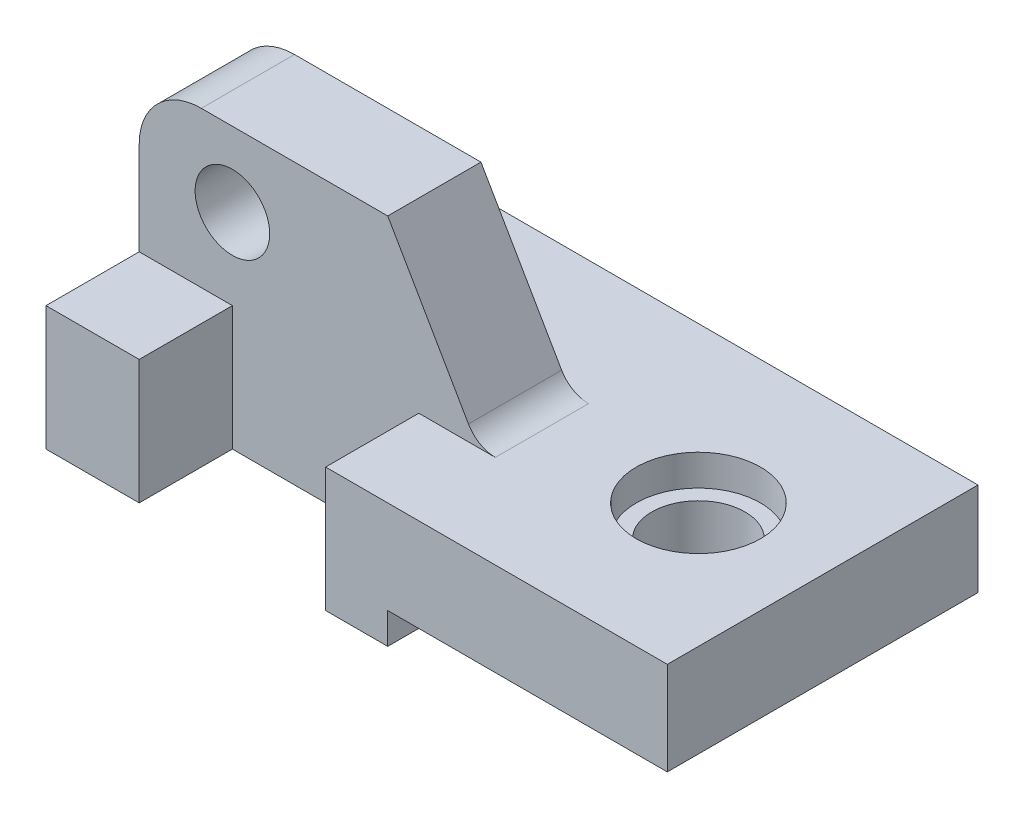
ISO-10303-21;
HEADER;
FILE_DESCRIPTION(('STEP AP214'),'2;1');
FILE_NAME('part.step','',(''),(''),'','','');
FILE_SCHEMA(('AUTOMOTIVE_DESIGN { 1 0 10303 214 1 1 1 1 }'));
ENDSEC;
DATA;
#1=APPLICATION_CONTEXT('core data for automotive mechanical design processes');
#2=APPLICATION_PROTOCOL_DEFINITION('international standard','automotive_design',2000,#1);
#3=PRODUCT_CONTEXT('',#1,'mechanical');
#4=PRODUCT('Part','Part','',(#3));
#5=PRODUCT_RELATED_PRODUCT_CATEGORY('part','',(#4));
#6=PRODUCT_DEFINITION_FORMATION('','',#4);
#7=PRODUCT_DEFINITION_CONTEXT('part definition',#1,'design');
#8=PRODUCT_DEFINITION('design','',#6,#7);
#9=PRODUCT_DEFINITION_SHAPE('','',#8);
#10=(LENGTH_UNIT() NAMED_UNIT(*) SI_UNIT(.MILLI.,.METRE.));
#11=(NAMED_UNIT(*) PLANE_ANGLE_UNIT() SI_UNIT($,.RADIAN.));
#12=(NAMED_UNIT(*) SI_UNIT($,.STERADIAN.) SOLID_ANGLE_UNIT());
#13=UNCERTAINTY_MEASURE_WITH_UNIT(LENGTH_MEASURE(1.E-05),#10,'distance_accuracy_value','');
#14=(GEOMETRIC_REPRESENTATION_CONTEXT(3) GLOBAL_UNCERTAINTY_ASSIGNED_CONTEXT((#13)) GLOBAL_UNIT_ASSIGNED_CONTEXT((#10,
#11,#12)) REPRESENTATION_CONTEXT('',''));
#15=CARTESIAN_POINT('',(0.,0.,0.));
#16=DIRECTION('',(0.,0.,1.));
#17=DIRECTION('',(1.,0.,0.));
#18=AXIS2_PLACEMENT_3D('',#15,#16,#17);
#19=CARTESIAN_POINT('',(0.,20.,15.));
#20=DIRECTION('',(0.,-1.,0.));
#21=DIRECTION('',(1.,0.,0.));
#22=AXIS2_PLACEMENT_3D('',#19,#20,#21);
#23=PLANE('',#22);
#24=DIRECTION('',(1.,0.,0.));
#25=VECTOR('',#24,1.);
#26=CARTESIAN_POINT('',(0.,20.,-15.));
#27=LINE('',#26,#25);
#28=CARTESIAN_POINT('',(0.,20.,-15.));
#29=VERTEX_POINT('',#28);
#30=CARTESIAN_POINT('',(57.3205080756889,20.,-15.));
#31=VERTEX_POINT('',#30);
#32=EDGE_CURVE('E175',#29,#31,#27,.T.);
#33=ORIENTED_EDGE('',*,*,#32,.T.);
#34=DIRECTION('',(0.,0.,1.));
#35=VECTOR('',#34,1.);
#36=CARTESIAN_POINT('',(57.3205080756889,20.,-15.));
#37=LINE('',#36,#35);
#38=CARTESIAN_POINT('',(57.3205080756889,20.,0.));
#39=VERTEX_POINT('',#38);
#40=EDGE_CURVE('E162',#31,#39,#37,.T.);
#41=ORIENTED_EDGE('',*,*,#40,.T.);
#42=DIRECTION('',(1.,0.,0.));
#43=VECTOR('',#42,1.);
#44=CARTESIAN_POINT('',(0.,20.,0.));
#45=LINE('',#44,#43);
#46=CARTESIAN_POINT('',(45.,20.,0.));
#47=VERTEX_POINT('',#46);
#48=EDGE_CURVE('E202',#47,#39,#45,.T.);
#49=ORIENTED_EDGE('',*,*,#48,.F.);
#50=DIRECTION('',(0.,0.,-1.));
#51=VECTOR('',#50,1.);
#52=CARTESIAN_POINT('',(45.,20.,15.));
#53=LINE('',#52,#51);
#54=CARTESIAN_POINT('',(45.,20.,15.));
#55=VERTEX_POINT('',#54);
#56=EDGE_CURVE('E241',#55,#47,#53,.T.);
#57=ORIENTED_EDGE('',*,*,#56,.F.);
#58=DIRECTION('',(-1.,0.,0.));
#59=VECTOR('',#58,1.);
#60=CARTESIAN_POINT('',(0.,20.,15.));
#61=LINE('',#60,#59);
#62=CARTESIAN_POINT('',(100.,20.,15.));
#63=VERTEX_POINT('',#62);
#64=EDGE_CURVE('E220',#63,#55,#61,.T.);
#65=ORIENTED_EDGE('',*,*,#64,.F.);
#66=DIRECTION('',(0.,0.,1.));
#67=VECTOR('',#66,1.);
#68=CARTESIAN_POINT('',(100.,20.,-35.));
#69=LINE('',#68,#67);
#70=CARTESIAN_POINT('',(100.,20.,-35.));
#71=VERTEX_POINT('',#70);
#72=EDGE_CURVE('E263',#71,#63,#69,.T.);
#73=ORIENTED_EDGE('',*,*,#72,.F.);
#74=DIRECTION('',(-1.,0.,0.));
#75=VECTOR('',#74,1.);
#76=CARTESIAN_POINT('',(0.,20.,-35.));
#77=LINE('',#76,#75);
#78=CARTESIAN_POINT('',(0.,20.,-35.));
#79=VERTEX_POINT('',#78);
#80=EDGE_CURVE('E244',#71,#79,#77,.T.);
#81=ORIENTED_EDGE('',*,*,#80,.T.);
#82=DIRECTION('',(0.,0.,-1.));
#83=VECTOR('',#82,1.);
#84=CARTESIAN_POINT('',(0.,20.,15.));
#85=LINE('',#84,#83);
#86=EDGE_CURVE('E183',#29,#79,#85,.T.);
#87=ORIENTED_EDGE('',*,*,#86,.F.);
#88=EDGE_LOOP('',(#33,#41,#49,#57,#65,#73,#81,#87));
#89=FACE_BOUND('',#88,.T.);
#90=CARTESIAN_POINT('',(80.,20.,-10.));
#91=DIRECTION('',(0.,1.,0.));
#92=DIRECTION('',(0.,0.,1.));
#93=AXIS2_PLACEMENT_3D('',#90,#91,#92);
#94=CIRCLE('',#93,10.);
#95=CARTESIAN_POINT('',(80.,20.,0.));
#96=VERTEX_POINT('',#95);
#97=EDGE_CURVE('E353',#96,#96,#94,.T.);
#98=ORIENTED_EDGE('',*,*,#97,.F.);
#99=EDGE_LOOP('',(#98));
#100=FACE_BOUND('',#99,.T.);
#101=ADVANCED_FACE('F45',(#89,#100),#23,.F.);
#102=CARTESIAN_POINT('',(0.,0.,0.));
#103=DIRECTION('',(0.,0.,-1.));
#104=DIRECTION('',(-1.,0.,0.));
#105=AXIS2_PLACEMENT_3D('',#102,#103,#104);
#106=PLANE('',#105);
#107=DIRECTION('',(0.,-1.,0.));
#108=VECTOR('',#107,1.);
#109=CARTESIAN_POINT('',(45.,0.,0.));
#110=LINE('',#109,#108);
#111=CARTESIAN_POINT('',(45.,0.,0.));
#112=VERTEX_POINT('',#111);
#113=EDGE_CURVE('E214',#47,#112,#110,.T.);
#114=ORIENTED_EDGE('',*,*,#113,.F.);
#115=ORIENTED_EDGE('',*,*,#48,.T.);
#116=CARTESIAN_POINT('',(57.3205080756889,25.,0.));
#117=DIRECTION('',(0.,0.,-1.));
#118=DIRECTION('',(1.,0.,0.));
#119=AXIS2_PLACEMENT_3D('',#116,#117,#118);
#120=CIRCLE('',#119,5.);
#121=CARTESIAN_POINT('',(52.9903810567667,22.5,0.));
#122=VERTEX_POINT('',#121);
#123=EDGE_CURVE('E167',#39,#122,#120,.T.);
#124=ORIENTED_EDGE('',*,*,#123,.T.);
#125=DIRECTION('',(-0.500000000000004,0.866025403784436,0.));
#126=VECTOR('',#125,1.);
#127=CARTESIAN_POINT('',(40.,45.,0.));
#128=LINE('',#127,#126);
#129=CARTESIAN_POINT('',(40.,45.,0.));
#130=VERTEX_POINT('',#129);
#131=EDGE_CURVE('E204',#122,#130,#128,.T.);
#132=ORIENTED_EDGE('',*,*,#131,.T.);
#133=DIRECTION('',(-1.,0.,0.));
#134=VECTOR('',#133,1.);
#135=CARTESIAN_POINT('',(40.,45.,0.));
#136=LINE('',#135,#134);
#137=CARTESIAN_POINT('',(10.0000000000001,45.,0.));
#138=VERTEX_POINT('',#137);
#139=EDGE_CURVE('E207',#130,#138,#136,.T.);
#140=ORIENTED_EDGE('',*,*,#139,.T.);
#141=CARTESIAN_POINT('',(10.,35.,0.));
#142=DIRECTION('',(0.,0.,1.));
#143=DIRECTION('',(1.,0.,0.));
#144=AXIS2_PLACEMENT_3D('',#141,#142,#143);
#145=CIRCLE('',#144,10.);
#146=CARTESIAN_POINT('',(0.,34.9999999999999,0.));
#147=VERTEX_POINT('',#146);
#148=EDGE_CURVE('E186',#138,#147,#145,.T.);
#149=ORIENTED_EDGE('',*,*,#148,.T.);
#150=DIRECTION('',(0.,-1.,0.));
#151=VECTOR('',#150,1.);
#152=CARTESIAN_POINT('',(0.,34.9999999999999,0.));
#153=LINE('',#152,#151);
#154=CARTESIAN_POINT('',(0.,20.,0.));
#155=VERTEX_POINT('',#154);
#156=EDGE_CURVE('E184',#147,#155,#153,.T.);
#157=ORIENTED_EDGE('',*,*,#156,.T.);
#158=CARTESIAN_POINT('',(15.,20.,0.));
#159=VERTEX_POINT('',#158);
#160=EDGE_CURVE('E200',#155,#159,#45,.T.);
#161=ORIENTED_EDGE('',*,*,#160,.T.);
#162=DIRECTION('',(0.,-1.,0.));
#163=VECTOR('',#162,1.);
#164=CARTESIAN_POINT('',(15.,0.,0.));
#165=LINE('',#164,#163);
#166=CARTESIAN_POINT('',(15.,0.,0.));
#167=VERTEX_POINT('',#166);
#168=EDGE_CURVE('E265',#159,#167,#165,.T.);
#169=ORIENTED_EDGE('',*,*,#168,.T.);
#170=DIRECTION('',(1.,0.,0.));
#171=VECTOR('',#170,1.);
#172=CARTESIAN_POINT('',(55.,0.,0.));
#173=LINE('',#172,#171);
#174=EDGE_CURVE('E69',#167,#112,#173,.T.);
#175=ORIENTED_EDGE('',*,*,#174,.T.);
#176=EDGE_LOOP('',(#114,#115,#124,#132,#140,#149,#157,#161,#169,#175));
#177=FACE_BOUND('',#176,.T.);
#178=CARTESIAN_POINT('',(15.,33.,0.));
#179=DIRECTION('',(0.,0.,1.));
#180=DIRECTION('',(1.,0.,0.));
#181=AXIS2_PLACEMENT_3D('',#178,#179,#180);
#182=CIRCLE('',#181,6.);
#183=CARTESIAN_POINT('',(21.,33.,0.));
#184=VERTEX_POINT('',#183);
#185=EDGE_CURVE('E189',#184,#184,#182,.T.);
#186=ORIENTED_EDGE('',*,*,#185,.F.);
#187=EDGE_LOOP('',(#186));
#188=FACE_BOUND('',#187,.T.);
#189=ADVANCED_FACE('F329',(#177,#188),#106,.F.);
#190=CARTESIAN_POINT('',(15.,0.,15.));
#191=DIRECTION('',(1.,0.,0.));
#192=DIRECTION('',(0.,1.,0.));
#193=AXIS2_PLACEMENT_3D('',#190,#191,#192);
#194=PLANE('',#193);
#195=ORIENTED_EDGE('',*,*,#168,.F.);
#196=DIRECTION('',(0.,0.,-1.));
#197=VECTOR('',#196,1.);
#198=CARTESIAN_POINT('',(15.,20.,15.));
#199=LINE('',#198,#197);
#200=CARTESIAN_POINT('',(15.,20.,15.));
#201=VERTEX_POINT('',#200);
#202=EDGE_CURVE('E13',#201,#159,#199,.T.);
#203=ORIENTED_EDGE('',*,*,#202,.F.);
#204=DIRECTION('',(0.,-1.,0.));
#205=VECTOR('',#204,1.);
#206=CARTESIAN_POINT('',(15.,0.,15.));
#207=LINE('',#206,#205);
#208=CARTESIAN_POINT('',(15.,0.,15.));
#209=VERTEX_POINT('',#208);
#210=EDGE_CURVE('E271',#201,#209,#207,.T.);
#211=ORIENTED_EDGE('',*,*,#210,.T.);
#212=DIRECTION('',(0.,0.,-1.));
#213=VECTOR('',#212,1.);
#214=CARTESIAN_POINT('',(15.,0.,15.));
#215=LINE('',#214,#213);
#216=EDGE_CURVE('E280',#209,#167,#215,.T.);
#217=ORIENTED_EDGE('',*,*,#216,.T.);
#218=EDGE_LOOP('',(#195,#203,#211,#217));
#219=FACE_BOUND('',#218,.T.);
#220=ADVANCED_FACE('F47',(#219),#194,.T.);
#221=ORIENTED_EDGE('',*,*,#202,.T.);
#222=ORIENTED_EDGE('',*,*,#160,.F.);
#223=CARTESIAN_POINT('',(0.,20.,15.));
#224=VERTEX_POINT('',#223);
#225=EDGE_CURVE('E54',#224,#155,#85,.T.);
#226=ORIENTED_EDGE('',*,*,#225,.F.);
#227=DIRECTION('',(-1.,0.,0.));
#228=VECTOR('',#227,1.);
#229=CARTESIAN_POINT('',(0.,20.,15.));
#230=LINE('',#229,#228);
#231=EDGE_CURVE('E274',#201,#224,#230,.T.);
#232=ORIENTED_EDGE('',*,*,#231,.F.);
#233=EDGE_LOOP('',(#221,#222,#226,#232));
#234=FACE_BOUND('',#233,.T.);
#235=ADVANCED_FACE('F328',(#234),#23,.F.);
#236=CARTESIAN_POINT('',(0.,0.,15.));
#237=DIRECTION('',(1.,0.,0.));
#238=DIRECTION('',(0.,1.,0.));
#239=AXIS2_PLACEMENT_3D('',#236,#237,#238);
#240=PLANE('',#239);
#241=ORIENTED_EDGE('',*,*,#225,.T.);
#242=ORIENTED_EDGE('',*,*,#156,.F.);
#243=DIRECTION('',(0.,0.,1.));
#244=VECTOR('',#243,1.);
#245=CARTESIAN_POINT('',(0.,34.9999999999999,-15.));
#246=LINE('',#245,#244);
#247=CARTESIAN_POINT('',(0.,34.9999999999999,-15.));
#248=VERTEX_POINT('',#247);
#249=EDGE_CURVE('E212',#248,#147,#246,.T.);
#250=ORIENTED_EDGE('',*,*,#249,.F.);
#251=DIRECTION('',(0.,-1.,0.));
#252=VECTOR('',#251,1.);
#253=CARTESIAN_POINT('',(0.,34.9999999999999,-15.));
#254=LINE('',#253,#252);
#255=EDGE_CURVE('E61',#248,#29,#254,.T.);
#256=ORIENTED_EDGE('',*,*,#255,.T.);
#257=ORIENTED_EDGE('',*,*,#86,.T.);
#258=DIRECTION('',(0.,-1.,0.));
#259=VECTOR('',#258,1.);
#260=CARTESIAN_POINT('',(0.,0.,-35.));
#261=LINE('',#260,#259);
#262=CARTESIAN_POINT('',(0.,0.,-35.));
#263=VERTEX_POINT('',#262);
#264=EDGE_CURVE('E246',#79,#263,#261,.T.);
#265=ORIENTED_EDGE('',*,*,#264,.T.);
#266=DIRECTION('',(0.,0.,-1.));
#267=VECTOR('',#266,1.);
#268=CARTESIAN_POINT('',(0.,0.,15.));
#269=LINE('',#268,#267);
#270=CARTESIAN_POINT('',(0.,0.,15.));
#271=VERTEX_POINT('',#270);
#272=EDGE_CURVE('E283',#271,#263,#269,.T.);
#273=ORIENTED_EDGE('',*,*,#272,.F.);
#274=DIRECTION('',(0.,-1.,0.));
#275=VECTOR('',#274,1.);
#276=CARTESIAN_POINT('',(0.,0.,15.));
#277=LINE('',#276,#275);
#278=EDGE_CURVE('E276',#224,#271,#277,.T.);
#279=ORIENTED_EDGE('',*,*,#278,.F.);
#280=EDGE_LOOP('',(#241,#242,#250,#256,#257,#265,#273,#279));
#281=FACE_BOUND('',#280,.T.);
#282=ADVANCED_FACE('F290',(#281),#240,.F.);
#283=CARTESIAN_POINT('',(0.,0.,15.));
#284=DIRECTION('',(0.,1.,0.));
#285=DIRECTION('',(0.,0.,1.));
#286=AXIS2_PLACEMENT_3D('',#283,#284,#285);
#287=PLANE('',#286);
#288=ORIENTED_EDGE('',*,*,#272,.T.);
#289=DIRECTION('',(1.,0.,0.));
#290=VECTOR('',#289,1.);
#291=CARTESIAN_POINT('',(55.,0.,-35.));
#292=LINE('',#291,#290);
#293=CARTESIAN_POINT('',(55.,0.,-35.));
#294=VERTEX_POINT('',#293);
#295=EDGE_CURVE('E249',#263,#294,#292,.T.);
#296=ORIENTED_EDGE('',*,*,#295,.T.);
#297=DIRECTION('',(0.,0.,1.));
#298=VECTOR('',#297,1.);
#299=CARTESIAN_POINT('',(55.,0.,-35.));
#300=LINE('',#299,#298);
#301=CARTESIAN_POINT('',(55.,0.,15.));
#302=VERTEX_POINT('',#301);
#303=EDGE_CURVE('E261',#294,#302,#300,.T.);
#304=ORIENTED_EDGE('',*,*,#303,.T.);
#305=DIRECTION('',(1.,0.,0.));
#306=VECTOR('',#305,1.);
#307=CARTESIAN_POINT('',(0.,0.,15.));
#308=LINE('',#307,#306);
#309=CARTESIAN_POINT('',(45.,0.,15.));
#310=VERTEX_POINT('',#309);
#311=EDGE_CURVE('E225',#310,#302,#308,.T.);
#312=ORIENTED_EDGE('',*,*,#311,.F.);
#313=DIRECTION('',(0.,0.,-1.));
#314=VECTOR('',#313,1.);
#315=CARTESIAN_POINT('',(45.,0.,15.));
#316=LINE('',#315,#314);
#317=EDGE_CURVE('E237',#310,#112,#316,.T.);
#318=ORIENTED_EDGE('',*,*,#317,.T.);
#319=ORIENTED_EDGE('',*,*,#174,.F.);
#320=ORIENTED_EDGE('',*,*,#216,.F.);
#321=DIRECTION('',(1.,0.,0.));
#322=VECTOR('',#321,1.);
#323=CARTESIAN_POINT('',(0.,0.,15.));
#324=LINE('',#323,#322);
#325=EDGE_CURVE('E278',#271,#209,#324,.T.);
#326=ORIENTED_EDGE('',*,*,#325,.F.);
#327=EDGE_LOOP('',(#288,#296,#304,#312,#318,#319,#320,#326));
#328=FACE_BOUND('',#327,.T.);
#329=ADVANCED_FACE('F314',(#328),#287,.F.);
#330=CARTESIAN_POINT('',(0.,0.,15.));
#331=DIRECTION('',(0.,0.,1.));
#332=DIRECTION('',(1.,0.,0.));
#333=AXIS2_PLACEMENT_3D('',#330,#331,#332);
#334=PLANE('',#333);
#335=ORIENTED_EDGE('',*,*,#210,.F.);
#336=ORIENTED_EDGE('',*,*,#231,.T.);
#337=ORIENTED_EDGE('',*,*,#278,.T.);
#338=ORIENTED_EDGE('',*,*,#325,.T.);
#339=EDGE_LOOP('',(#335,#336,#337,#338));
#340=FACE_BOUND('',#339,.T.);
#341=ADVANCED_FACE('F325',(#340),#334,.T.);
#342=CARTESIAN_POINT('',(100.,20.,-35.));
#343=DIRECTION('',(1.,0.,0.));
#344=DIRECTION('',(0.,0.,-1.));
#345=AXIS2_PLACEMENT_3D('',#342,#343,#344);
#346=PLANE('',#345);
#347=ORIENTED_EDGE('',*,*,#72,.T.);
#348=DIRECTION('',(0.,1.,0.));
#349=VECTOR('',#348,1.);
#350=CARTESIAN_POINT('',(100.,0.,15.));
#351=LINE('',#350,#349);
#352=CARTESIAN_POINT('',(100.,5.00000000000002,15.));
#353=VERTEX_POINT('',#352);
#354=EDGE_CURVE('E234',#353,#63,#351,.T.);
#355=ORIENTED_EDGE('',*,*,#354,.F.);
#356=DIRECTION('',(0.,0.,1.));
#357=VECTOR('',#356,1.);
#358=CARTESIAN_POINT('',(100.,5.00000000000002,-35.));
#359=LINE('',#358,#357);
#360=CARTESIAN_POINT('',(100.,5.00000000000002,-35.));
#361=VERTEX_POINT('',#360);
#362=EDGE_CURVE('E266',#361,#353,#359,.T.);
#363=ORIENTED_EDGE('',*,*,#362,.F.);
#364=DIRECTION('',(0.,1.,0.));
#365=VECTOR('',#364,1.);
#366=CARTESIAN_POINT('',(100.,20.,-35.));
#367=LINE('',#366,#365);
#368=EDGE_CURVE('E258',#361,#71,#367,.T.);
#369=ORIENTED_EDGE('',*,*,#368,.T.);
#370=EDGE_LOOP('',(#347,#355,#363,#369));
#371=FACE_BOUND('',#370,.T.);
#372=ADVANCED_FACE('F302',(#371),#346,.T.);
#373=CARTESIAN_POINT('',(100.,5.00000000000002,-35.));
#374=DIRECTION('',(0.,-1.,0.));
#375=DIRECTION('',(0.,0.,-1.));
#376=AXIS2_PLACEMENT_3D('',#373,#374,#375);
#377=PLANE('',#376);
#378=CARTESIAN_POINT('',(80.,5.00000000000002,-10.));
#379=DIRECTION('',(0.,-1.,0.));
#380=DIRECTION('',(0.,0.,-1.));
#381=AXIS2_PLACEMENT_3D('',#378,#379,#380);
#382=CIRCLE('',#381,7.50000000000001);
#383=CARTESIAN_POINT('',(80.,5.00000000000002,-17.5));
#384=VERTEX_POINT('',#383);
#385=EDGE_CURVE('E49',#384,#384,#382,.T.);
#386=ORIENTED_EDGE('',*,*,#385,.F.);
#387=EDGE_LOOP('',(#386));
#388=FACE_BOUND('',#387,.T.);
#389=ORIENTED_EDGE('',*,*,#362,.T.);
#390=DIRECTION('',(1.,0.,0.));
#391=VECTOR('',#390,1.);
#392=CARTESIAN_POINT('',(0.,5.00000000000002,15.));
#393=LINE('',#392,#391);
#394=CARTESIAN_POINT('',(55.,5.00000000000002,15.));
#395=VERTEX_POINT('',#394);
#396=EDGE_CURVE('E231',#395,#353,#393,.T.);
#397=ORIENTED_EDGE('',*,*,#396,.F.);
#398=DIRECTION('',(0.,0.,1.));
#399=VECTOR('',#398,1.);
#400=CARTESIAN_POINT('',(55.,5.00000000000002,-35.));
#401=LINE('',#400,#399);
#402=CARTESIAN_POINT('',(55.,5.00000000000002,-35.));
#403=VERTEX_POINT('',#402);
#404=EDGE_CURVE('E268',#403,#395,#401,.T.);
#405=ORIENTED_EDGE('',*,*,#404,.F.);
#406=DIRECTION('',(1.,0.,0.));
#407=VECTOR('',#406,1.);
#408=CARTESIAN_POINT('',(100.,5.00000000000002,-35.));
#409=LINE('',#408,#407);
#410=EDGE_CURVE('E255',#403,#361,#409,.T.);
#411=ORIENTED_EDGE('',*,*,#410,.T.);
#412=EDGE_LOOP('',(#389,#397,#405,#411));
#413=FACE_BOUND('',#412,.T.);
#414=ADVANCED_FACE('F308',(#388,#413),#377,.T.);
#415=CARTESIAN_POINT('',(55.,5.00000000000002,-35.));
#416=DIRECTION('',(1.,0.,0.));
#417=DIRECTION('',(0.,0.,-1.));
#418=AXIS2_PLACEMENT_3D('',#415,#416,#417);
#419=PLANE('',#418);
#420=ORIENTED_EDGE('',*,*,#404,.T.);
#421=DIRECTION('',(0.,1.,0.));
#422=VECTOR('',#421,1.);
#423=CARTESIAN_POINT('',(55.,0.,15.));
#424=LINE('',#423,#422);
#425=EDGE_CURVE('E228',#302,#395,#424,.T.);
#426=ORIENTED_EDGE('',*,*,#425,.F.);
#427=ORIENTED_EDGE('',*,*,#303,.F.);
#428=DIRECTION('',(0.,1.,0.));
#429=VECTOR('',#428,1.);
#430=CARTESIAN_POINT('',(55.,5.00000000000002,-35.));
#431=LINE('',#430,#429);
#432=EDGE_CURVE('E252',#294,#403,#431,.T.);
#433=ORIENTED_EDGE('',*,*,#432,.T.);
#434=EDGE_LOOP('',(#420,#426,#427,#433));
#435=FACE_BOUND('',#434,.T.);
#436=ADVANCED_FACE('F311',(#435),#419,.T.);
#437=CARTESIAN_POINT('',(0.,0.,-35.));
#438=DIRECTION('',(0.,0.,-1.));
#439=DIRECTION('',(-1.,0.,0.));
#440=AXIS2_PLACEMENT_3D('',#437,#438,#439);
#441=PLANE('',#440);
#442=ORIENTED_EDGE('',*,*,#80,.F.);
#443=ORIENTED_EDGE('',*,*,#368,.F.);
#444=ORIENTED_EDGE('',*,*,#410,.F.);
#445=ORIENTED_EDGE('',*,*,#432,.F.);
#446=ORIENTED_EDGE('',*,*,#295,.F.);
#447=ORIENTED_EDGE('',*,*,#264,.F.);
#448=EDGE_LOOP('',(#442,#443,#444,#445,#446,#447));
#449=FACE_BOUND('',#448,.T.);
#450=ADVANCED_FACE('F295',(#449),#441,.T.);
#451=CARTESIAN_POINT('',(45.,0.,15.));
#452=DIRECTION('',(1.,0.,0.));
#453=DIRECTION('',(0.,1.,0.));
#454=AXIS2_PLACEMENT_3D('',#451,#452,#453);
#455=PLANE('',#454);
#456=ORIENTED_EDGE('',*,*,#113,.T.);
#457=ORIENTED_EDGE('',*,*,#317,.F.);
#458=DIRECTION('',(0.,-1.,0.));
#459=VECTOR('',#458,1.);
#460=CARTESIAN_POINT('',(45.,0.,15.));
#461=LINE('',#460,#459);
#462=EDGE_CURVE('E223',#55,#310,#461,.T.);
#463=ORIENTED_EDGE('',*,*,#462,.F.);
#464=ORIENTED_EDGE('',*,*,#56,.T.);
#465=EDGE_LOOP('',(#456,#457,#463,#464));
#466=FACE_BOUND('',#465,.T.);
#467=ADVANCED_FACE('F317',(#466),#455,.F.);
#468=CARTESIAN_POINT('',(0.,0.,15.));
#469=DIRECTION('',(0.,0.,1.));
#470=DIRECTION('',(1.,0.,0.));
#471=AXIS2_PLACEMENT_3D('',#468,#469,#470);
#472=PLANE('',#471);
#473=ORIENTED_EDGE('',*,*,#64,.T.);
#474=ORIENTED_EDGE('',*,*,#462,.T.);
#475=ORIENTED_EDGE('',*,*,#311,.T.);
#476=ORIENTED_EDGE('',*,*,#425,.T.);
#477=ORIENTED_EDGE('',*,*,#396,.T.);
#478=ORIENTED_EDGE('',*,*,#354,.T.);
#479=EDGE_LOOP('',(#473,#474,#475,#476,#477,#478));
#480=FACE_BOUND('',#479,.T.);
#481=ADVANCED_FACE('F304',(#480),#472,.T.);
#482=CARTESIAN_POINT('',(10.,35.,-15.));
#483=DIRECTION('',(0.,0.,1.));
#484=DIRECTION('',(1.,0.,0.));
#485=AXIS2_PLACEMENT_3D('',#482,#483,#484);
#486=CYLINDRICAL_SURFACE('',#485,10.);
#487=ORIENTED_EDGE('',*,*,#148,.F.);
#488=DIRECTION('',(0.,0.,1.));
#489=VECTOR('',#488,1.);
#490=CARTESIAN_POINT('',(10.0000000000001,45.,-15.));
#491=LINE('',#490,#489);
#492=CARTESIAN_POINT('',(10.0000000000001,45.,-15.));
#493=VERTEX_POINT('',#492);
#494=EDGE_CURVE('E215',#493,#138,#491,.T.);
#495=ORIENTED_EDGE('',*,*,#494,.F.);
#496=CARTESIAN_POINT('',(10.,35.,-15.));
#497=DIRECTION('',(0.,0.,1.));
#498=DIRECTION('',(1.,0.,0.));
#499=AXIS2_PLACEMENT_3D('',#496,#497,#498);
#500=CIRCLE('',#499,10.);
#501=EDGE_CURVE('E196',#493,#248,#500,.T.);
#502=ORIENTED_EDGE('',*,*,#501,.T.);
#503=ORIENTED_EDGE('',*,*,#249,.T.);
#504=EDGE_LOOP('',(#487,#495,#502,#503));
#505=FACE_BOUND('',#504,.T.);
#506=ADVANCED_FACE('F334',(#505),#486,.T.);
#507=CARTESIAN_POINT('',(40.,45.,-15.));
#508=DIRECTION('',(0.,1.,0.));
#509=DIRECTION('',(-1.,0.,0.));
#510=AXIS2_PLACEMENT_3D('',#507,#508,#509);
#511=PLANE('',#510);
#512=ORIENTED_EDGE('',*,*,#139,.F.);
#513=DIRECTION('',(0.,0.,1.));
#514=VECTOR('',#513,1.);
#515=CARTESIAN_POINT('',(40.,45.,-15.));
#516=LINE('',#515,#514);
#517=CARTESIAN_POINT('',(40.,45.,-15.));
#518=VERTEX_POINT('',#517);
#519=EDGE_CURVE('E217',#518,#130,#516,.T.);
#520=ORIENTED_EDGE('',*,*,#519,.F.);
#521=DIRECTION('',(-1.,0.,0.));
#522=VECTOR('',#521,1.);
#523=CARTESIAN_POINT('',(40.,45.,-15.));
#524=LINE('',#523,#522);
#525=EDGE_CURVE('E193',#518,#493,#524,.T.);
#526=ORIENTED_EDGE('',*,*,#525,.T.);
#527=ORIENTED_EDGE('',*,*,#494,.T.);
#528=EDGE_LOOP('',(#512,#520,#526,#527));
#529=FACE_BOUND('',#528,.T.);
#530=ADVANCED_FACE('F337',(#529),#511,.T.);
#531=CARTESIAN_POINT('',(40.,45.,-15.));
#532=DIRECTION('',(0.866025403784436,0.500000000000004,0.));
#533=DIRECTION('',(-0.500000000000004,0.866025403784436,0.));
#534=AXIS2_PLACEMENT_3D('',#531,#532,#533);
#535=PLANE('',#534);
#536=ORIENTED_EDGE('',*,*,#131,.F.);
#537=DIRECTION('',(0.,0.,1.));
#538=VECTOR('',#537,1.);
#539=CARTESIAN_POINT('',(52.9903810567667,22.5,-15.));
#540=LINE('',#539,#538);
#541=CARTESIAN_POINT('',(52.9903810567667,22.5,-15.));
#542=VERTEX_POINT('',#541);
#543=EDGE_CURVE('E170',#542,#122,#540,.T.);
#544=ORIENTED_EDGE('',*,*,#543,.F.);
#545=DIRECTION('',(-0.500000000000004,0.866025403784436,0.));
#546=VECTOR('',#545,1.);
#547=CARTESIAN_POINT('',(40.,45.,-15.));
#548=LINE('',#547,#546);
#549=EDGE_CURVE('E179',#542,#518,#548,.T.);
#550=ORIENTED_EDGE('',*,*,#549,.T.);
#551=ORIENTED_EDGE('',*,*,#519,.T.);
#552=EDGE_LOOP('',(#536,#544,#550,#551));
#553=FACE_BOUND('',#552,.T.);
#554=ADVANCED_FACE('F340',(#553),#535,.T.);
#555=CARTESIAN_POINT('',(57.3205080756889,25.,-15.));
#556=DIRECTION('',(0.,0.,1.));
#557=DIRECTION('',(1.,0.,0.));
#558=AXIS2_PLACEMENT_3D('',#555,#556,#557);
#559=CYLINDRICAL_SURFACE('',#558,5.);
#560=ORIENTED_EDGE('',*,*,#123,.F.);
#561=ORIENTED_EDGE('',*,*,#40,.F.);
#562=CARTESIAN_POINT('',(57.3205080756889,25.,-15.));
#563=DIRECTION('',(0.,0.,-1.));
#564=DIRECTION('',(1.,0.,0.));
#565=AXIS2_PLACEMENT_3D('',#562,#563,#564);
#566=CIRCLE('',#565,5.);
#567=EDGE_CURVE('E165',#31,#542,#566,.T.);
#568=ORIENTED_EDGE('',*,*,#567,.T.);
#569=ORIENTED_EDGE('',*,*,#543,.T.);
#570=EDGE_LOOP('',(#560,#561,#568,#569));
#571=FACE_BOUND('',#570,.T.);
#572=ADVANCED_FACE('F164',(#571),#559,.F.);
#573=CARTESIAN_POINT('',(57.3205080756889,25.,-15.));
#574=DIRECTION('',(0.,0.,1.));
#575=DIRECTION('',(1.,0.,0.));
#576=AXIS2_PLACEMENT_3D('',#573,#574,#575);
#577=PLANE('',#576);
#578=CARTESIAN_POINT('',(15.,33.,-15.));
#579=DIRECTION('',(0.,0.,1.));
#580=DIRECTION('',(1.,0.,0.));
#581=AXIS2_PLACEMENT_3D('',#578,#579,#580);
#582=CIRCLE('',#581,6.);
#583=CARTESIAN_POINT('',(21.,33.,-15.));
#584=VERTEX_POINT('',#583);
#585=EDGE_CURVE('E341',#584,#584,#582,.T.);
#586=ORIENTED_EDGE('',*,*,#585,.T.);
#587=EDGE_LOOP('',(#586));
#588=FACE_BOUND('',#587,.T.);
#589=ORIENTED_EDGE('',*,*,#32,.F.);
#590=ORIENTED_EDGE('',*,*,#255,.F.);
#591=ORIENTED_EDGE('',*,*,#501,.F.);
#592=ORIENTED_EDGE('',*,*,#525,.F.);
#593=ORIENTED_EDGE('',*,*,#549,.F.);
#594=ORIENTED_EDGE('',*,*,#567,.F.);
#595=EDGE_LOOP('',(#589,#590,#591,#592,#593,#594));
#596=FACE_BOUND('',#595,.T.);
#597=ADVANCED_FACE('F174',(#588,#596),#577,.F.);
#598=CARTESIAN_POINT('',(15.,33.,-15.));
#599=DIRECTION('',(0.,0.,1.));
#600=DIRECTION('',(1.,0.,0.));
#601=AXIS2_PLACEMENT_3D('',#598,#599,#600);
#602=CYLINDRICAL_SURFACE('',#601,6.);
#603=ORIENTED_EDGE('',*,*,#585,.F.);
#604=EDGE_LOOP('',(#603));
#605=FACE_BOUND('',#604,.T.);
#606=ORIENTED_EDGE('',*,*,#185,.T.);
#607=EDGE_LOOP('',(#606));
#608=FACE_BOUND('',#607,.T.);
#609=ADVANCED_FACE('F486',(#605,#608),#602,.F.);
#610=CARTESIAN_POINT('',(80.,20.,-10.));
#611=DIRECTION('',(0.,1.,0.));
#612=DIRECTION('',(0.,0.,1.));
#613=AXIS2_PLACEMENT_3D('',#610,#611,#612);
#614=CYLINDRICAL_SURFACE('',#613,7.50000000000001);
#615=ORIENTED_EDGE('',*,*,#385,.T.);
#616=EDGE_LOOP('',(#615));
#617=FACE_BOUND('',#616,.T.);
#618=CARTESIAN_POINT('',(80.,15.,-10.));
#619=DIRECTION('',(0.,1.,0.));
#620=DIRECTION('',(0.,0.,1.));
#621=AXIS2_PLACEMENT_3D('',#618,#619,#620);
#622=CIRCLE('',#621,7.50000000000001);
#623=CARTESIAN_POINT('',(80.,15.,-2.5));
#624=VERTEX_POINT('',#623);
#625=EDGE_CURVE('E347',#624,#624,#622,.T.);
#626=ORIENTED_EDGE('',*,*,#625,.T.);
#627=EDGE_LOOP('',(#626));
#628=FACE_BOUND('',#627,.T.);
#629=ADVANCED_FACE('F494',(#617,#628),#614,.F.);
#630=CARTESIAN_POINT('',(87.5,15.,-10.));
#631=DIRECTION('',(0.,-1.,0.));
#632=DIRECTION('',(0.,0.,-1.));
#633=AXIS2_PLACEMENT_3D('',#630,#631,#632);
#634=PLANE('',#633);
#635=ORIENTED_EDGE('',*,*,#625,.F.);
#636=EDGE_LOOP('',(#635));
#637=FACE_BOUND('',#636,.T.);
#638=CARTESIAN_POINT('',(80.,15.,-10.));
#639=DIRECTION('',(0.,1.,0.));
#640=DIRECTION('',(0.,0.,1.));
#641=AXIS2_PLACEMENT_3D('',#638,#639,#640);
#642=CIRCLE('',#641,10.);
#643=CARTESIAN_POINT('',(80.,15.,0.));
#644=VERTEX_POINT('',#643);
#645=EDGE_CURVE('E350',#644,#644,#642,.T.);
#646=ORIENTED_EDGE('',*,*,#645,.T.);
#647=EDGE_LOOP('',(#646));
#648=FACE_BOUND('',#647,.T.);
#649=ADVANCED_FACE('F519',(#637,#648),#634,.F.);
#650=CARTESIAN_POINT('',(80.,20.,-10.));
#651=DIRECTION('',(0.,1.,0.));
#652=DIRECTION('',(0.,0.,1.));
#653=AXIS2_PLACEMENT_3D('',#650,#651,#652);
#654=CYLINDRICAL_SURFACE('',#653,10.);
#655=ORIENTED_EDGE('',*,*,#645,.F.);
#656=EDGE_LOOP('',(#655));
#657=FACE_BOUND('',#656,.T.);
#658=ORIENTED_EDGE('',*,*,#97,.T.);
#659=EDGE_LOOP('',(#658));
#660=FACE_BOUND('',#659,.T.);
#661=ADVANCED_FACE('F357',(#657,#660),#654,.F.);
#662=CLOSED_SHELL('',(#101,#189,#220,#235,#282,#329,#341,#372,#414,#436,#450,#467,#481,#506,
#530,#554,#572,#597,#609,#629,#649,#661));
#663=MANIFOLD_SOLID_BREP('B2',#662);
#664=ADVANCED_BREP_SHAPE_REPRESENTATION('',(#18,#663),#14);
#665=SHAPE_DEFINITION_REPRESENTATION(#9,#664);
ENDSEC;
END-ISO-10303-21;
